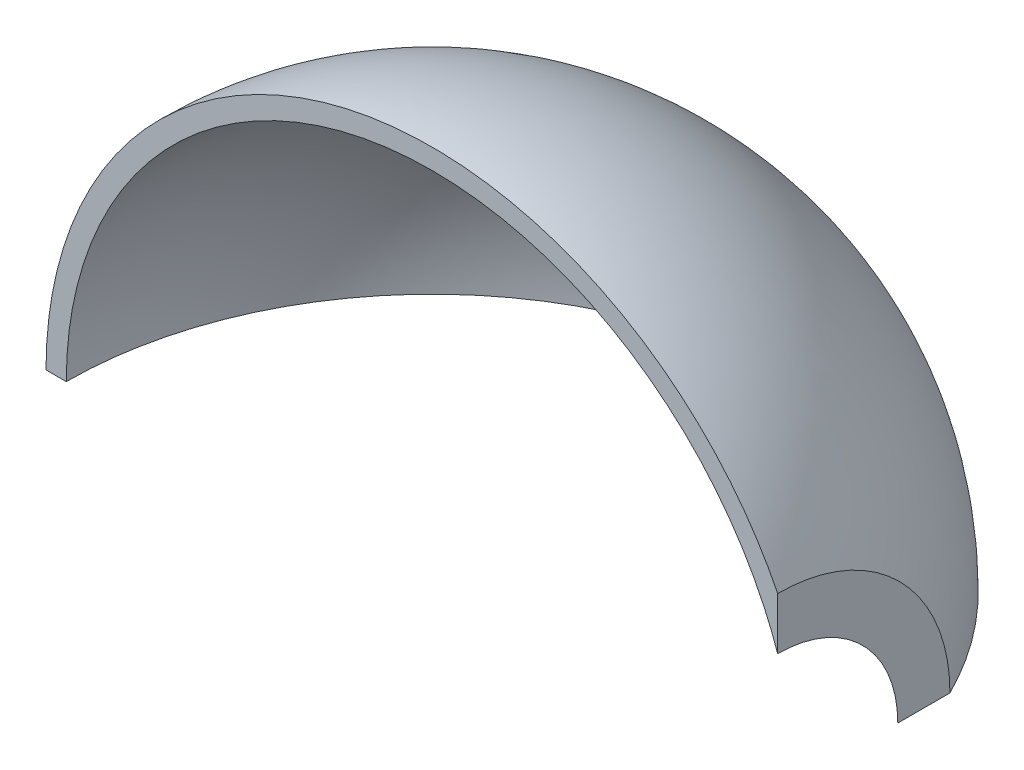
ISO-10303-21;
HEADER;
FILE_DESCRIPTION(('STEP AP214'),'2;1');
FILE_NAME('part.step','',(''),(''),'','','');
FILE_SCHEMA(('AUTOMOTIVE_DESIGN { 1 0 10303 214 1 1 1 1 }'));
ENDSEC;
DATA;
#1=APPLICATION_CONTEXT('core data for automotive mechanical design processes');
#2=APPLICATION_PROTOCOL_DEFINITION('international standard','automotive_design',2000,#1);
#3=PRODUCT_CONTEXT('',#1,'mechanical');
#4=PRODUCT('Part','Part','',(#3));
#5=PRODUCT_RELATED_PRODUCT_CATEGORY('part','',(#4));
#6=PRODUCT_DEFINITION_FORMATION('','',#4);
#7=PRODUCT_DEFINITION_CONTEXT('part definition',#1,'design');
#8=PRODUCT_DEFINITION('design','',#6,#7);
#9=PRODUCT_DEFINITION_SHAPE('','',#8);
#10=(LENGTH_UNIT() NAMED_UNIT(*) SI_UNIT(.MILLI.,.METRE.));
#11=(NAMED_UNIT(*) PLANE_ANGLE_UNIT() SI_UNIT($,.RADIAN.));
#12=(NAMED_UNIT(*) SI_UNIT($,.STERADIAN.) SOLID_ANGLE_UNIT());
#13=UNCERTAINTY_MEASURE_WITH_UNIT(LENGTH_MEASURE(1.E-05),#10,'distance_accuracy_value','');
#14=(GEOMETRIC_REPRESENTATION_CONTEXT(3) GLOBAL_UNCERTAINTY_ASSIGNED_CONTEXT((#13)) GLOBAL_UNIT_ASSIGNED_CONTEXT((#10,
#11,#12)) REPRESENTATION_CONTEXT('',''));
#15=CARTESIAN_POINT('',(0.,0.,0.));
#16=DIRECTION('',(0.,0.,1.));
#17=DIRECTION('',(1.,0.,0.));
#18=AXIS2_PLACEMENT_3D('',#15,#16,#17);
#19=CARTESIAN_POINT('',(-95.25,0.,0.));
#20=CARTESIAN_POINT('',(-95.2499997723106,0.,-3.88671533786089));
#21=CARTESIAN_POINT('',(-94.87489845994,0.,-10.7810568937979));
#22=CARTESIAN_POINT('',(-93.4228058749728,0.,-20.3270306510887));
#23=CARTESIAN_POINT('',(-89.9348838220804,-1.1244347983598E-13,-32.2050926021095));
#24=CARTESIAN_POINT('',(-85.5254323480102,-1.48447791551952E-13,-42.5171373251958));
#25=CARTESIAN_POINT('',(-80.1052206981418,-1.81606111492039E-13,-52.0140576069102));
#26=CARTESIAN_POINT('',(-73.6349119075366,-2.12384525671411E-13,-60.8293457875913));
#27=CARTESIAN_POINT('',(-66.1993458222866,-2.40379208905765E-13,-68.8473417375938));
#28=CARTESIAN_POINT('',(-57.8960171553853,-2.65223022875004E-13,-75.9628928627992));
#29=CARTESIAN_POINT('',(-48.8337765144813,-2.8659026585895E-13,-82.0827144829904));
#30=CARTESIAN_POINT('',(-39.1314252911762,-3.04200835336847E-13,-87.1265820477335));
#31=CARTESIAN_POINT('',(-30.1930457829105,-3.16121024381462E-13,-90.5406598811167));
#32=CARTESIAN_POINT('',(-22.2946799501063,-3.2373453599715E-13,-92.7212562746838));
#33=CARTESIAN_POINT('',(-15.5981683022686,-3.28304530140726E-13,-94.0301546189864));
#34=CARTESIAN_POINT('',(-10.1897936650292,-3.30883781952334E-13,-94.7688816982102));
#35=CARTESIAN_POINT('',(-3.42527217178253,-3.3274098042544E-13,-95.3008044819426));
#36=CARTESIAN_POINT('',(4.69263556233674,-3.3281623839548E-13,-95.3223592212453));
#37=CARTESIAN_POINT('',(14.1068262103996,-3.29791326343701E-13,-94.4559899761554));
#38=CARTESIAN_POINT('',(24.6645078397834,-3.22137143329757E-13,-92.2637448311535));
#39=CARTESIAN_POINT('',(34.9077609863371,-3.10376483007206E-13,-88.8953578397319));
#40=CARTESIAN_POINT('',(43.4812450127731,-2.96623905131419E-13,-84.9564629864819));
#41=CARTESIAN_POINT('',(50.4737588485688,-2.82488357783471E-13,-80.9078813169515));
#42=CARTESIAN_POINT('',(56.0266388155761,-2.69221213173258E-13,-77.1080200767912));
#43=CARTESIAN_POINT('',(60.290264598857,-2.57748780733136E-13,-73.8221848318797));
#44=CARTESIAN_POINT('',(64.3615825669936,-2.45454308066905E-13,-70.3009079086854));
#45=CARTESIAN_POINT('',(68.2276154135699,-2.32376989382784E-13,-66.5554149746022));
#46=CARTESIAN_POINT('',(71.4199768809207,-2.20285874820058E-13,-63.0923821271367));
#47=CARTESIAN_POINT('',(74.0130074347682,-2.09486389982369E-13,-59.9992867359217));
#48=CARTESIAN_POINT('',(76.0749320363973,-2.00210896875069E-13,-57.3426799243345));
#49=CARTESIAN_POINT('',(77.465204448416,-1.93578255623484E-13,-55.4430159685816));
#50=CARTESIAN_POINT('',(78.6181295092219,-1.87797300528534E-13,-53.7872846230817));
#51=CARTESIAN_POINT('',(79.552764992972,-1.82917398984952E-13,-52.3896252716504));
#52=CARTESIAN_POINT('',(80.2845257307379,-1.78977616642975E-13,-51.2612267612111));
#53=CARTESIAN_POINT('',(81.0004957836854,-1.75000631129612E-13,-50.1221728389923));
#54=CARTESIAN_POINT('',(81.6998844393724,-1.70991770600358E-13,-48.9739895493797));
#55=CARTESIAN_POINT('',(82.3838639793349,-1.66942636130232E-13,-47.8142713446513));
#56=CARTESIAN_POINT('',(83.0495865058557,-1.62873031683758E-13,-46.6486903056811));
#57=CARTESIAN_POINT('',(83.621083166184,-1.59259333124943E-13,-45.6136859026468));
#58=CARTESIAN_POINT('',(84.0952202949987,-1.5617912499133E-13,-44.7314792302681));
#59=CARTESIAN_POINT('',(84.4461207653408,-1.53846177469515E-13,-44.0632965033947));
#60=CARTESIAN_POINT('',(84.6861725482402,-1.52224789142859E-13,-43.5989124299021));
#61=CARTESIAN_POINT('',(84.9255750444254,-1.50589366861552E-13,-43.1305088720445));
#62=CARTESIAN_POINT('',(85.0789181386475,-1.49530543412124E-13,-42.8272497832309));
#63=CARTESIAN_POINT('',(85.1817219244542,-1.48814953805666E-13,-42.622296774175));
#64=CARTESIAN_POINT('',(85.2500000000002,-1.48336602700678E-13,-42.4852915724957));
#65=B_SPLINE_CURVE_WITH_KNOTS('',4,(#19,#20,#21,#22,#23,#24,#25,#26,#27,#28,#29,#30,#31,#32,#33,
#34,#35,#36,#37,#38,#39,#40,#41,#42,#43,#44,#45,#46,#47,#48,#49,#50,#51,#52,#53,#54,#55,#56,#57,
#58,#59,#60,#61,#62,#63,#64),.UNSPECIFIED.,.F.,.F.,(5,1,1,1,1,1,1,1,1,1,1,1,1,1,1,1,1,1,1,1,1,1,
1,1,1,1,1,1,1,1,1,1,1,1,1,1,1,1,1,1,1,1,5),(0.,0.0554663301366343,0.0983871184672756,
0.137312410001337,0.176239098148313,0.215166578111958,0.254094253958464,0.293022159197454,
0.331949944274651,0.370877710144305,0.409805438856409,0.448733219487936,0.468197121465774,
0.487661023443611,0.507124932324616,0.526588841205622,0.56497707122922,0.603365275240267,
0.641753578562052,0.680141773477492,0.718529797343044,0.737723979456571,0.756918161570099,
0.776112310376626,0.795306459183154,0.814500444273051,0.833694429362948,0.843291398938428,
0.852888368513908,0.862485338089388,0.867283822877128,0.872082307664868,0.876880949530772,
0.881679591396675,0.886478233262579,0.891276875128482,0.896075516994386,0.900874158860289,
0.903273479793241,0.905672800726192,0.906872461192668,0.908072121659144,0.910471442592096),.UNSPECIFIED.);
#66=CARTESIAN_POINT('',(-95.25,0.,0.));
#67=DIRECTION('',(1.,0.,0.));
#68=AXIS1_PLACEMENT('',#66,#67);
#69=SURFACE_OF_REVOLUTION('',#65,#68);
#70=CARTESIAN_POINT('',(-95.25,0.,0.));
#71=CARTESIAN_POINT('',(-95.2499997723106,3.88671533786089,0.));
#72=CARTESIAN_POINT('',(-94.87489845994,10.7810568937979,0.));
#73=CARTESIAN_POINT('',(-93.4228058749728,20.3270306510887,0.));
#74=CARTESIAN_POINT('',(-89.9348838220804,32.2050926021095,0.));
#75=CARTESIAN_POINT('',(-85.5254323480102,42.5171373251958,0.));
#76=CARTESIAN_POINT('',(-80.1052206981418,52.0140576069102,0.));
#77=CARTESIAN_POINT('',(-73.6349119075366,60.8293457875913,0.));
#78=CARTESIAN_POINT('',(-66.1993458222866,68.8473417375938,0.));
#79=CARTESIAN_POINT('',(-57.8960171553853,75.9628928627992,0.));
#80=CARTESIAN_POINT('',(-48.8337765144813,82.0827144829904,0.));
#81=CARTESIAN_POINT('',(-39.1314252911762,87.1265820477335,0.));
#82=CARTESIAN_POINT('',(-30.1930457829105,90.5406598811167,0.));
#83=CARTESIAN_POINT('',(-22.2946799501063,92.7212562746838,0.));
#84=CARTESIAN_POINT('',(-15.5981683022686,94.0301546189864,0.));
#85=CARTESIAN_POINT('',(-10.1897936650292,94.7688816982102,0.));
#86=CARTESIAN_POINT('',(-3.42527217178253,95.3008044819426,0.));
#87=CARTESIAN_POINT('',(4.69263556233674,95.3223592212453,0.));
#88=CARTESIAN_POINT('',(14.1068262103996,94.4559899761554,0.));
#89=CARTESIAN_POINT('',(24.6645078397834,92.2637448311535,0.));
#90=CARTESIAN_POINT('',(34.9077609863371,88.8953578397319,0.));
#91=CARTESIAN_POINT('',(43.4812450127731,84.9564629864819,0.));
#92=CARTESIAN_POINT('',(50.4737588485688,80.9078813169515,0.));
#93=CARTESIAN_POINT('',(56.0266388155761,77.1080200767912,0.));
#94=CARTESIAN_POINT('',(60.290264598857,73.8221848318797,0.));
#95=CARTESIAN_POINT('',(64.3615825669936,70.3009079086854,0.));
#96=CARTESIAN_POINT('',(68.2276154135699,66.5554149746022,0.));
#97=CARTESIAN_POINT('',(71.4199768809207,63.0923821271367,0.));
#98=CARTESIAN_POINT('',(74.0130074347682,59.9992867359217,0.));
#99=CARTESIAN_POINT('',(76.0749320363973,57.3426799243345,0.));
#100=CARTESIAN_POINT('',(77.465204448416,55.4430159685816,0.));
#101=CARTESIAN_POINT('',(78.6181295092219,53.7872846230817,0.));
#102=CARTESIAN_POINT('',(79.552764992972,52.3896252716504,0.));
#103=CARTESIAN_POINT('',(80.2845257307379,51.2612267612111,0.));
#104=CARTESIAN_POINT('',(81.0004957836854,50.1221728389923,0.));
#105=CARTESIAN_POINT('',(81.6998844393724,48.9739895493797,0.));
#106=CARTESIAN_POINT('',(82.3838639793349,47.8142713446513,0.));
#107=CARTESIAN_POINT('',(83.0495865058557,46.6486903056811,0.));
#108=CARTESIAN_POINT('',(83.621083166184,45.6136859026468,0.));
#109=CARTESIAN_POINT('',(84.0952202949987,44.7314792302681,0.));
#110=CARTESIAN_POINT('',(84.4461207653408,44.0632965033947,0.));
#111=CARTESIAN_POINT('',(84.6861725482402,43.5989124299021,0.));
#112=CARTESIAN_POINT('',(84.9255750444254,43.1305088720445,0.));
#113=CARTESIAN_POINT('',(85.0789181386475,42.8272497832309,0.));
#114=CARTESIAN_POINT('',(85.1817219244542,42.622296774175,0.));
#115=CARTESIAN_POINT('',(85.2500000000002,42.4852915724957,0.));
#116=B_SPLINE_CURVE_WITH_KNOTS('',4,(#70,#71,#72,#73,#74,#75,#76,#77,#78,#79,#80,#81,#82,#83,
#84,#85,#86,#87,#88,#89,#90,#91,#92,#93,#94,#95,#96,#97,#98,#99,#100,#101,#102,#103,#104,#105,
#106,#107,#108,#109,#110,#111,#112,#113,#114,#115),.UNSPECIFIED.,.F.,.F.,(5,1,1,1,1,1,1,1,1,1,1,
1,1,1,1,1,1,1,1,1,1,1,1,1,1,1,1,1,1,1,1,1,1,1,1,1,1,1,1,1,1,1,5),(0.,0.0554663301366343,
0.0983871184672756,0.137312410001337,0.176239098148313,0.215166578111958,0.254094253958464,
0.293022159197454,0.331949944274651,0.370877710144305,0.409805438856409,0.448733219487936,
0.468197121465774,0.487661023443611,0.507124932324616,0.526588841205622,0.56497707122922,
0.603365275240267,0.641753578562052,0.680141773477492,0.718529797343044,0.737723979456571,
0.756918161570099,0.776112310376626,0.795306459183154,0.814500444273051,0.833694429362948,
0.843291398938428,0.852888368513908,0.862485338089388,0.867283822877128,0.872082307664868,
0.876880949530772,0.881679591396675,0.886478233262579,0.891276875128482,0.896075516994386,
0.900874158860289,0.903273479793241,0.905672800726192,0.906872461192668,0.908072121659144,
0.910471442592096),.UNSPECIFIED.);
#117=CARTESIAN_POINT('',(-95.25,0.,0.));
#118=VERTEX_POINT('',#117);
#119=CARTESIAN_POINT('',(85.25,42.485291572496,0.));
#120=VERTEX_POINT('',#119);
#121=EDGE_CURVE('E62',#118,#120,#116,.T.);
#122=ORIENTED_EDGE('',*,*,#121,.T.);
#123=CARTESIAN_POINT('',(85.25,0.,0.));
#124=DIRECTION('',(1.,0.,0.));
#125=DIRECTION('',(0.,0.,-1.));
#126=AXIS2_PLACEMENT_3D('',#123,#124,#125);
#127=CIRCLE('',#126,42.485291572496);
#128=CARTESIAN_POINT('',(85.25,-1.48336602700679E-13,-42.485291572496));
#129=VERTEX_POINT('',#128);
#130=EDGE_CURVE('E55',#129,#120,#127,.T.);
#131=ORIENTED_EDGE('',*,*,#130,.F.);
#132=EDGE_CURVE('E94',#118,#129,#65,.T.);
#133=ORIENTED_EDGE('',*,*,#132,.F.);
#134=EDGE_LOOP('',(#122,#131,#133));
#135=FACE_BOUND('',#134,.T.);
#136=ADVANCED_FACE('F46',(#135),#69,.T.);
#137=CARTESIAN_POINT('',(-90.25,0.,0.));
#138=CARTESIAN_POINT('',(-90.2499995597366,0.,-3.70535414671838));
#139=CARTESIAN_POINT('',(-89.8841133905335,0.,-10.3891971280831));
#140=CARTESIAN_POINT('',(-88.4623620903456,0.,-19.5769432443805));
#141=CARTESIAN_POINT('',(-85.0633927645408,-1.08069991954323E-13,-30.9524758881085));
#142=CARTESIAN_POINT('',(-80.7769131232861,-1.4245213158461E-13,-40.7999120601946));
#143=CARTESIAN_POINT('',(-75.595472532755,-1.73694438097714E-13,-49.7480642858788));
#144=CARTESIAN_POINT('',(-69.4269484950229,-2.02669728462315E-13,-58.0469172805225));
#145=CARTESIAN_POINT('',(-62.3519566165169,-2.28999107213471E-13,-65.587951069888));
#146=CARTESIAN_POINT('',(-54.4628948946734,-2.52338677361162E-13,-72.2726696413539));
#147=CARTESIAN_POINT('',(-45.8627606800537,-2.72383731206099E-13,-78.0138012412663));
#148=CARTESIAN_POINT('',(-36.6638241407171,-2.88872558659237E-13,-82.7363891210005));
#149=CARTESIAN_POINT('',(-26.9862000701185,-3.01589848762341E-13,-86.3787657711696));
#150=CARTESIAN_POINT('',(-16.956231513128,-3.10369561790619E-13,-88.8933755245149));
#151=CARTESIAN_POINT('',(-6.45806280468676,-3.15210888166602E-13,-90.2799865088334));
#152=CARTESIAN_POINT('',(4.38163982235221,-3.15715569235209E-13,-90.4245329118149));
#153=CARTESIAN_POINT('',(15.4087790355768,-3.11527945834226E-13,-89.225149900829));
#154=CARTESIAN_POINT('',(25.0626705026387,-3.03504977030738E-13,-86.9272803077049));
#155=CARTESIAN_POINT('',(33.0781635589509,-2.93663401836873E-13,-84.1085411426472));
#156=CARTESIAN_POINT('',(39.5328424267393,-2.83553786913276E-13,-81.2130323478195));
#157=CARTESIAN_POINT('',(44.5413938917959,-2.74352830240395E-13,-78.5777736195201));
#158=CARTESIAN_POINT('',(50.5834640158752,-2.61505301896625E-13,-74.8980952546841));
#159=CARTESIAN_POINT('',(57.4462526348133,-2.44014760494688E-13,-69.8886050972106));
#160=CARTESIAN_POINT('',(64.8076951098435,-2.20779805647925E-13,-63.2338495387971));
#161=CARTESIAN_POINT('',(70.8172261362621,-1.96390243970115E-13,-56.2484014407442));
#162=CARTESIAN_POINT('',(74.9089665115916,-1.76226154472301E-13,-50.4731766748299));
#163=CARTESIAN_POINT('',(77.5119675789592,-1.61527343741559E-13,-46.263269960675));
#164=CARTESIAN_POINT('',(78.9233125766434,-1.52969381440961E-13,-43.8121721399909));
#165=CARTESIAN_POINT('',(80.0904539690254,-1.45349620880999E-13,-41.6297859776503));
#166=CARTESIAN_POINT('',(81.0415909905499,-1.38730121095523E-13,-39.7338858873838));
#167=CARTESIAN_POINT('',(81.8010348640092,-1.33157115215184E-13,-38.1377135640954));
#168=CARTESIAN_POINT('',(82.3884215964874,-1.28666929739905E-13,-36.8516733308783));
#169=CARTESIAN_POINT('',(82.9558058600653,-1.24142943985432E-13,-35.5559523129415));
#170=CARTESIAN_POINT('',(83.4340024686468,-1.201622904767E-13,-34.4158478350954));
#171=CARTESIAN_POINT('',(83.8318102245866,-1.16724566325757E-13,-33.4312445056438));
#172=CARTESIAN_POINT('',(84.1543524357697,-1.13851771252488E-13,-32.6084432947912));
#173=CARTESIAN_POINT('',(84.374087913864,-1.11850028384005E-13,-32.0351213508318));
#174=CARTESIAN_POINT('',(84.5600914792367,-1.10120965430958E-13,-31.5398980386489));
#175=CARTESIAN_POINT('',(84.7470977464473,-1.08352377580205E-13,-31.0333543458395));
#176=CARTESIAN_POINT('',(84.9355227626688,-1.06540082121858E-13,-30.5142922966786));
#177=CARTESIAN_POINT('',(85.0897610097501,-1.05027113551203E-13,-30.0809608754783));
#178=CARTESIAN_POINT('',(85.1968745444136,-1.03960653300858E-13,-29.7755145199498));
#179=CARTESIAN_POINT('',(85.2499999997453,-1.03426847590129E-13,-29.6226264879304));
#180=B_SPLINE_CURVE_WITH_KNOTS('',4,(#137,#138,#139,#140,#141,#142,#143,#144,#145,#146,#147,
#148,#149,#150,#151,#152,#153,#154,#155,#156,#157,#158,#159,#160,#161,#162,#163,#164,#165,#166,
#167,#168,#169,#170,#171,#172,#173,#174,#175,#176,#177,#178,#179),.UNSPECIFIED.,.F.,.F.,(5,1,1,
1,1,1,1,1,1,1,1,1,1,1,1,1,1,1,1,1,1,1,1,1,1,1,1,1,1,1,1,1,1,1,1,1,1,1,1,5),(0.,
0.0535732455364841,0.0966370170099646,0.133928186584481,0.171222227227071,0.208516895634992,
0.245811780922175,0.283106382210343,0.320401143303378,0.357695858193727,0.394990842145124,
0.432285693734901,0.469580497990611,0.506875341601761,0.547762112413576,0.588648839632627,
0.629535582061296,0.649978984752951,0.670422387444606,0.690865839771341,0.711309292098077,
0.752195771234283,0.793082194287594,0.833968592479685,0.844190413377406,0.854412234275126,
0.864634055172846,0.874855876070566,0.879966820949118,0.885077765827671,0.890188710706223,
0.895299655584775,0.900410600463327,0.902966072902603,0.90552154534188,0.908077017781156,
0.909354754000794,0.910632490220432,0.913187962659708,0.915743435098984),.UNSPECIFIED.);
#181=CARTESIAN_POINT('',(-95.25,0.,0.));
#182=DIRECTION('',(1.,0.,0.));
#183=AXIS1_PLACEMENT('',#181,#182);
#184=SURFACE_OF_REVOLUTION('',#180,#183);
#185=CARTESIAN_POINT('',(85.25,0.,0.));
#186=DIRECTION('',(1.,0.,0.));
#187=DIRECTION('',(0.,0.,-1.));
#188=AXIS2_PLACEMENT_3D('',#185,#186,#187);
#189=CIRCLE('',#188,29.6226264878721);
#190=CARTESIAN_POINT('',(85.25,-1.03426847589926E-13,-29.6226264878721));
#191=VERTEX_POINT('',#190);
#192=CARTESIAN_POINT('',(85.25,29.6226264878721,0.));
#193=VERTEX_POINT('',#192);
#194=EDGE_CURVE('E13',#191,#193,#189,.T.);
#195=ORIENTED_EDGE('',*,*,#194,.T.);
#196=CARTESIAN_POINT('',(-90.25,0.,0.));
#197=CARTESIAN_POINT('',(-90.2499995597366,3.70535414671838,0.));
#198=CARTESIAN_POINT('',(-89.8841133905335,10.3891971280831,0.));
#199=CARTESIAN_POINT('',(-88.4623620903456,19.5769432443805,0.));
#200=CARTESIAN_POINT('',(-85.0633927645408,30.9524758881085,0.));
#201=CARTESIAN_POINT('',(-80.7769131232861,40.7999120601946,0.));
#202=CARTESIAN_POINT('',(-75.595472532755,49.7480642858788,0.));
#203=CARTESIAN_POINT('',(-69.4269484950229,58.0469172805225,0.));
#204=CARTESIAN_POINT('',(-62.3519566165169,65.587951069888,0.));
#205=CARTESIAN_POINT('',(-54.4628948946734,72.2726696413539,0.));
#206=CARTESIAN_POINT('',(-45.8627606800537,78.0138012412663,0.));
#207=CARTESIAN_POINT('',(-36.6638241407171,82.7363891210005,0.));
#208=CARTESIAN_POINT('',(-26.9862000701185,86.3787657711696,0.));
#209=CARTESIAN_POINT('',(-16.956231513128,88.8933755245149,0.));
#210=CARTESIAN_POINT('',(-6.45806280468676,90.2799865088334,0.));
#211=CARTESIAN_POINT('',(4.38163982235221,90.4245329118149,0.));
#212=CARTESIAN_POINT('',(15.4087790355768,89.225149900829,0.));
#213=CARTESIAN_POINT('',(25.0626705026387,86.9272803077049,0.));
#214=CARTESIAN_POINT('',(33.0781635589509,84.1085411426472,0.));
#215=CARTESIAN_POINT('',(39.5328424267393,81.2130323478195,0.));
#216=CARTESIAN_POINT('',(44.5413938917959,78.5777736195201,0.));
#217=CARTESIAN_POINT('',(50.5834640158752,74.8980952546841,0.));
#218=CARTESIAN_POINT('',(57.4462526348133,69.8886050972106,0.));
#219=CARTESIAN_POINT('',(64.8076951098435,63.2338495387971,0.));
#220=CARTESIAN_POINT('',(70.8172261362621,56.2484014407442,0.));
#221=CARTESIAN_POINT('',(74.9089665115916,50.4731766748299,0.));
#222=CARTESIAN_POINT('',(77.5119675789592,46.263269960675,0.));
#223=CARTESIAN_POINT('',(78.9233125766434,43.8121721399909,0.));
#224=CARTESIAN_POINT('',(80.0904539690254,41.6297859776503,0.));
#225=CARTESIAN_POINT('',(81.0415909905499,39.7338858873838,0.));
#226=CARTESIAN_POINT('',(81.8010348640092,38.1377135640954,0.));
#227=CARTESIAN_POINT('',(82.3884215964874,36.8516733308783,0.));
#228=CARTESIAN_POINT('',(82.9558058600653,35.5559523129415,0.));
#229=CARTESIAN_POINT('',(83.4340024686468,34.4158478350954,0.));
#230=CARTESIAN_POINT('',(83.8318102245866,33.4312445056438,0.));
#231=CARTESIAN_POINT('',(84.1543524357697,32.6084432947912,0.));
#232=CARTESIAN_POINT('',(84.374087913864,32.0351213508318,0.));
#233=CARTESIAN_POINT('',(84.5600914792367,31.5398980386489,0.));
#234=CARTESIAN_POINT('',(84.7470977464473,31.0333543458395,0.));
#235=CARTESIAN_POINT('',(84.9355227626688,30.5142922966786,0.));
#236=CARTESIAN_POINT('',(85.0897610097501,30.0809608754783,0.));
#237=CARTESIAN_POINT('',(85.1968745444136,29.7755145199498,0.));
#238=CARTESIAN_POINT('',(85.2499999997453,29.6226264879304,0.));
#239=B_SPLINE_CURVE_WITH_KNOTS('',4,(#196,#197,#198,#199,#200,#201,#202,#203,#204,#205,#206,
#207,#208,#209,#210,#211,#212,#213,#214,#215,#216,#217,#218,#219,#220,#221,#222,#223,#224,#225,
#226,#227,#228,#229,#230,#231,#232,#233,#234,#235,#236,#237,#238),.UNSPECIFIED.,.F.,.F.,(5,1,1,
1,1,1,1,1,1,1,1,1,1,1,1,1,1,1,1,1,1,1,1,1,1,1,1,1,1,1,1,1,1,1,1,1,1,1,1,5),(0.,
0.0535732455364841,0.0966370170099646,0.133928186584481,0.171222227227071,0.208516895634992,
0.245811780922175,0.283106382210343,0.320401143303378,0.357695858193727,0.394990842145124,
0.432285693734901,0.469580497990611,0.506875341601761,0.547762112413576,0.588648839632627,
0.629535582061296,0.649978984752951,0.670422387444606,0.690865839771341,0.711309292098077,
0.752195771234283,0.793082194287594,0.833968592479685,0.844190413377406,0.854412234275126,
0.864634055172846,0.874855876070566,0.879966820949118,0.885077765827671,0.890188710706223,
0.895299655584775,0.900410600463327,0.902966072902603,0.90552154534188,0.908077017781156,
0.909354754000794,0.910632490220432,0.913187962659708,0.915743435098984),.UNSPECIFIED.);
#240=CARTESIAN_POINT('',(-90.25,0.,0.));
#241=VERTEX_POINT('',#240);
#242=EDGE_CURVE('E69',#241,#193,#239,.T.);
#243=ORIENTED_EDGE('',*,*,#242,.F.);
#244=EDGE_CURVE('E128',#241,#191,#180,.T.);
#245=ORIENTED_EDGE('',*,*,#244,.T.);
#246=EDGE_LOOP('',(#195,#243,#245));
#247=FACE_BOUND('',#246,.T.);
#248=ADVANCED_FACE('F48',(#247),#184,.F.);
#249=CARTESIAN_POINT('',(85.25,-1.48336602700679E-13,-42.485291572496));
#250=DIRECTION('',(-1.,0.,0.));
#251=DIRECTION('',(0.,0.,1.));
#252=AXIS2_PLACEMENT_3D('',#249,#250,#251);
#253=PLANE('',#252);
#254=DIRECTION('',(0.,0.,1.));
#255=VECTOR('',#254,1.);
#256=CARTESIAN_POINT('',(85.25,-1.48336602700679E-13,-42.485291572496));
#257=LINE('',#256,#255);
#258=EDGE_CURVE('E87',#129,#191,#257,.T.);
#259=ORIENTED_EDGE('',*,*,#258,.F.);
#260=ORIENTED_EDGE('',*,*,#130,.T.);
#261=DIRECTION('',(0.,-1.,0.));
#262=VECTOR('',#261,1.);
#263=CARTESIAN_POINT('',(85.25,42.485291572496,0.));
#264=LINE('',#263,#262);
#265=EDGE_CURVE('E85',#120,#193,#264,.T.);
#266=ORIENTED_EDGE('',*,*,#265,.T.);
#267=ORIENTED_EDGE('',*,*,#194,.F.);
#268=EDGE_LOOP('',(#259,#260,#266,#267));
#269=FACE_BOUND('',#268,.T.);
#270=ADVANCED_FACE('F84',(#269),#253,.F.);
#271=CARTESIAN_POINT('',(-21.8231497857353,-3.23717237757476E-13,-92.7163018619301));
#272=DIRECTION('',(0.,1.,0.));
#273=DIRECTION('',(1.,0.,0.));
#274=AXIS2_PLACEMENT_3D('',#271,#272,#273);
#275=PLANE('',#274);
#276=ORIENTED_EDGE('',*,*,#132,.T.);
#277=ORIENTED_EDGE('',*,*,#258,.T.);
#278=ORIENTED_EDGE('',*,*,#244,.F.);
#279=DIRECTION('',(1.,0.,0.));
#280=VECTOR('',#279,1.);
#281=CARTESIAN_POINT('',(-95.25,0.,0.));
#282=LINE('',#281,#280);
#283=EDGE_CURVE('E91',#118,#241,#282,.T.);
#284=ORIENTED_EDGE('',*,*,#283,.F.);
#285=EDGE_LOOP('',(#276,#277,#278,#284));
#286=FACE_BOUND('',#285,.T.);
#287=ADVANCED_FACE('F118',(#286),#275,.F.);
#288=CARTESIAN_POINT('',(-21.8231497857353,92.7163018619301,0.));
#289=DIRECTION('',(0.,0.,1.));
#290=DIRECTION('',(1.,0.,0.));
#291=AXIS2_PLACEMENT_3D('',#288,#289,#290);
#292=PLANE('',#291);
#293=ORIENTED_EDGE('',*,*,#121,.F.);
#294=ORIENTED_EDGE('',*,*,#283,.T.);
#295=ORIENTED_EDGE('',*,*,#242,.T.);
#296=ORIENTED_EDGE('',*,*,#265,.F.);
#297=EDGE_LOOP('',(#293,#294,#295,#296));
#298=FACE_BOUND('',#297,.T.);
#299=ADVANCED_FACE('F92',(#298),#292,.T.);
#300=CLOSED_SHELL('',(#136,#248,#270,#287,#299));
#301=MANIFOLD_SOLID_BREP('B2',#300);
#302=ADVANCED_BREP_SHAPE_REPRESENTATION('',(#18,#301),#14);
#303=SHAPE_DEFINITION_REPRESENTATION(#9,#302);
ENDSEC;
END-ISO-10303-21;
